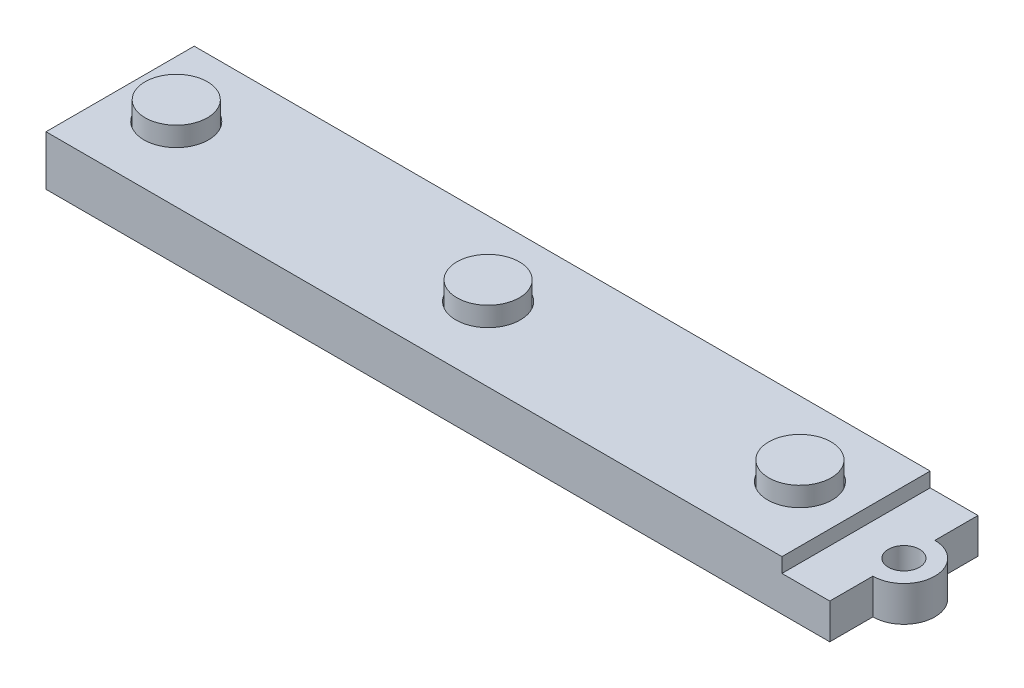
ISO-10303-21;
HEADER;
FILE_DESCRIPTION(('STEP AP214'),'2;1');
FILE_NAME('part.step','',(''),(''),'','','');
FILE_SCHEMA(('AUTOMOTIVE_DESIGN { 1 0 10303 214 1 1 1 1 }'));
ENDSEC;
DATA;
#1=APPLICATION_CONTEXT('core data for automotive mechanical design processes');
#2=APPLICATION_PROTOCOL_DEFINITION('international standard','automotive_design',2000,#1);
#3=PRODUCT_CONTEXT('',#1,'mechanical');
#4=PRODUCT('Part','Part','',(#3));
#5=PRODUCT_RELATED_PRODUCT_CATEGORY('part','',(#4));
#6=PRODUCT_DEFINITION_FORMATION('','',#4);
#7=PRODUCT_DEFINITION_CONTEXT('part definition',#1,'design');
#8=PRODUCT_DEFINITION('design','',#6,#7);
#9=PRODUCT_DEFINITION_SHAPE('','',#8);
#10=(LENGTH_UNIT() NAMED_UNIT(*) SI_UNIT(.MILLI.,.METRE.));
#11=(NAMED_UNIT(*) PLANE_ANGLE_UNIT() SI_UNIT($,.RADIAN.));
#12=(NAMED_UNIT(*) SI_UNIT($,.STERADIAN.) SOLID_ANGLE_UNIT());
#13=UNCERTAINTY_MEASURE_WITH_UNIT(LENGTH_MEASURE(1.E-05),#10,'distance_accuracy_value','');
#14=(GEOMETRIC_REPRESENTATION_CONTEXT(3) GLOBAL_UNCERTAINTY_ASSIGNED_CONTEXT((#13)) GLOBAL_UNIT_ASSIGNED_CONTEXT((#10,
#11,#12)) REPRESENTATION_CONTEXT('',''));
#15=CARTESIAN_POINT('',(0.,0.,0.));
#16=DIRECTION('',(0.,0.,1.));
#17=DIRECTION('',(1.,0.,0.));
#18=AXIS2_PLACEMENT_3D('',#15,#16,#17);
#19=CARTESIAN_POINT('',(0.,0.,0.));
#20=DIRECTION('',(0.,1.,0.));
#21=DIRECTION('',(0.,0.,1.));
#22=AXIS2_PLACEMENT_3D('',#19,#20,#21);
#23=PLANE('',#22);
#24=CARTESIAN_POINT('',(-20.4046666666667,0.,-25.8942737373737));
#25=DIRECTION('',(0.,1.,0.));
#26=DIRECTION('',(0.,0.,1.));
#27=AXIS2_PLACEMENT_3D('',#24,#25,#26);
#28=CIRCLE('',#27,1.905);
#29=CARTESIAN_POINT('',(-20.4046666666667,0.,-23.9892737373737));
#30=VERTEX_POINT('',#29);
#31=EDGE_CURVE('E210',#30,#30,#28,.T.);
#32=ORIENTED_EDGE('',*,*,#31,.T.);
#33=EDGE_LOOP('',(#32));
#34=FACE_BOUND('',#33,.T.);
#35=DIRECTION('',(0.,0.,-1.));
#36=VECTOR('',#35,1.);
#37=CARTESIAN_POINT('',(-112.479666666667,0.,-32.2442737373737));
#38=LINE('',#37,#36);
#39=CARTESIAN_POINT('',(-112.479666666667,0.,-19.5442737373737));
#40=VERTEX_POINT('',#39);
#41=CARTESIAN_POINT('',(-112.479666666667,0.,-32.2442737373737));
#42=VERTEX_POINT('',#41);
#43=EDGE_CURVE('E161',#40,#42,#38,.T.);
#44=ORIENTED_EDGE('',*,*,#43,.F.);
#45=DIRECTION('',(-1.,0.,0.));
#46=VECTOR('',#45,1.);
#47=CARTESIAN_POINT('',(-29.9296666666666,0.,-19.5442737373737));
#48=LINE('',#47,#46);
#49=CARTESIAN_POINT('',(-29.9296666666666,0.,-19.5442737373737));
#50=VERTEX_POINT('',#49);
#51=EDGE_CURVE('E166',#50,#40,#48,.T.);
#52=ORIENTED_EDGE('',*,*,#51,.F.);
#53=DIRECTION('',(0.,0.,1.));
#54=VECTOR('',#53,1.);
#55=CARTESIAN_POINT('',(-29.9296666666666,0.,-32.2442737373737));
#56=LINE('',#55,#54);
#57=CARTESIAN_POINT('',(-29.9296666666666,0.,-32.2442737373737));
#58=VERTEX_POINT('',#57);
#59=EDGE_CURVE('E176',#58,#50,#56,.T.);
#60=ORIENTED_EDGE('',*,*,#59,.F.);
#61=DIRECTION('',(1.,0.,0.));
#62=VECTOR('',#61,1.);
#63=CARTESIAN_POINT('',(-29.9296666666666,0.,-32.2442737373737));
#64=LINE('',#63,#62);
#65=EDGE_CURVE('E59',#42,#58,#64,.T.);
#66=ORIENTED_EDGE('',*,*,#65,.F.);
#67=EDGE_LOOP('',(#44,#52,#60,#66));
#68=FACE_BOUND('',#67,.T.);
#69=DIRECTION('',(-1.,0.,0.));
#70=VECTOR('',#69,1.);
#71=CARTESIAN_POINT('',(-116.162666666667,0.,-34.9493737373737));
#72=LINE('',#71,#70);
#73=CARTESIAN_POINT('',(-20.4046666666667,0.,-34.9493737373737));
#74=VERTEX_POINT('',#73);
#75=CARTESIAN_POINT('',(-116.162666666667,0.,-34.9493737373737));
#76=VERTEX_POINT('',#75);
#77=EDGE_CURVE('E232',#74,#76,#72,.T.);
#78=ORIENTED_EDGE('',*,*,#77,.F.);
#79=DIRECTION('',(0.,0.,1.));
#80=VECTOR('',#79,1.);
#81=CARTESIAN_POINT('',(-20.4046666666667,0.,0.));
#82=LINE('',#81,#80);
#83=CARTESIAN_POINT('',(-20.4046666666667,0.,-29.6800450522713));
#84=VERTEX_POINT('',#83);
#85=EDGE_CURVE('E158',#74,#84,#82,.T.);
#86=ORIENTED_EDGE('',*,*,#85,.T.);
#87=CARTESIAN_POINT('',(-20.4046666666667,0.,-25.8942737373737));
#88=DIRECTION('',(0.,1.,0.));
#89=DIRECTION('',(0.,0.,1.));
#90=AXIS2_PLACEMENT_3D('',#87,#88,#89);
#91=CIRCLE('',#90,3.78577131489756);
#92=CARTESIAN_POINT('',(-20.4046666666667,0.,-22.1085024224762));
#93=VERTEX_POINT('',#92);
#94=EDGE_CURVE('E154',#84,#93,#91,.F.);
#95=ORIENTED_EDGE('',*,*,#94,.T.);
#96=DIRECTION('',(0.,0.,1.));
#97=VECTOR('',#96,1.);
#98=CARTESIAN_POINT('',(-20.4046666666666,0.,0.));
#99=LINE('',#98,#97);
#100=CARTESIAN_POINT('',(-20.4046666666666,0.,-16.8391737373737));
#101=VERTEX_POINT('',#100);
#102=EDGE_CURVE('E132',#93,#101,#99,.T.);
#103=ORIENTED_EDGE('',*,*,#102,.T.);
#104=DIRECTION('',(1.,0.,0.));
#105=VECTOR('',#104,1.);
#106=CARTESIAN_POINT('',(-116.162666666667,0.,-16.8391737373737));
#107=LINE('',#106,#105);
#108=CARTESIAN_POINT('',(-116.162666666667,0.,-16.8391737373737));
#109=VERTEX_POINT('',#108);
#110=EDGE_CURVE('E239',#109,#101,#107,.T.);
#111=ORIENTED_EDGE('',*,*,#110,.F.);
#112=DIRECTION('',(0.,0.,1.));
#113=VECTOR('',#112,1.);
#114=CARTESIAN_POINT('',(-116.162666666667,0.,-34.9493737373737));
#115=LINE('',#114,#113);
#116=EDGE_CURVE('E225',#76,#109,#115,.T.);
#117=ORIENTED_EDGE('',*,*,#116,.F.);
#118=EDGE_LOOP('',(#78,#86,#95,#103,#111,#117));
#119=FACE_BOUND('',#118,.T.);
#120=ADVANCED_FACE('F36',(#34,#68,#119),#23,.F.);
#121=CARTESIAN_POINT('',(0.,4.318,0.));
#122=DIRECTION('',(0.,1.,0.));
#123=DIRECTION('',(0.,0.,1.));
#124=AXIS2_PLACEMENT_3D('',#121,#122,#123);
#125=PLANE('',#124);
#126=CARTESIAN_POINT('',(-20.4046666666667,4.318,-25.8942737373737));
#127=DIRECTION('',(0.,1.,0.));
#128=DIRECTION('',(0.,0.,1.));
#129=AXIS2_PLACEMENT_3D('',#126,#127,#128);
#130=CIRCLE('',#129,1.905);
#131=CARTESIAN_POINT('',(-20.4046666666667,4.318,-23.9892737373737));
#132=VERTEX_POINT('',#131);
#133=EDGE_CURVE('E207',#132,#132,#130,.T.);
#134=ORIENTED_EDGE('',*,*,#133,.F.);
#135=EDGE_LOOP('',(#134));
#136=FACE_BOUND('',#135,.T.);
#137=DIRECTION('',(0.,0.,1.));
#138=VECTOR('',#137,1.);
#139=CARTESIAN_POINT('',(-20.4046666666667,4.318,-34.9493737373737));
#140=LINE('',#139,#138);
#141=CARTESIAN_POINT('',(-20.4046666666667,4.318,-34.9493737373737));
#142=VERTEX_POINT('',#141);
#143=CARTESIAN_POINT('',(-20.4046666666667,4.318,-29.6800450522713));
#144=VERTEX_POINT('',#143);
#145=EDGE_CURVE('E51',#142,#144,#140,.T.);
#146=ORIENTED_EDGE('',*,*,#145,.F.);
#147=DIRECTION('',(-1.,0.,0.));
#148=VECTOR('',#147,1.);
#149=CARTESIAN_POINT('',(-26.2466666666667,4.318,-34.9493737373737));
#150=LINE('',#149,#148);
#151=CARTESIAN_POINT('',(-26.2466666666667,4.318,-34.9493737373737));
#152=VERTEX_POINT('',#151);
#153=EDGE_CURVE('E219',#142,#152,#150,.T.);
#154=ORIENTED_EDGE('',*,*,#153,.T.);
#155=DIRECTION('',(0.,0.,1.));
#156=VECTOR('',#155,1.);
#157=CARTESIAN_POINT('',(-26.2466666666667,4.318,-34.9493737373737));
#158=LINE('',#157,#156);
#159=CARTESIAN_POINT('',(-26.2466666666667,4.318,-16.8391737373737));
#160=VERTEX_POINT('',#159);
#161=EDGE_CURVE('E216',#152,#160,#158,.T.);
#162=ORIENTED_EDGE('',*,*,#161,.T.);
#163=DIRECTION('',(1.,0.,0.));
#164=VECTOR('',#163,1.);
#165=CARTESIAN_POINT('',(-26.2466666666667,4.318,-16.8391737373737));
#166=LINE('',#165,#164);
#167=CARTESIAN_POINT('',(-20.4046666666666,4.318,-16.8391737373737));
#168=VERTEX_POINT('',#167);
#169=EDGE_CURVE('E147',#160,#168,#166,.T.);
#170=ORIENTED_EDGE('',*,*,#169,.T.);
#171=DIRECTION('',(0.,0.,1.));
#172=VECTOR('',#171,1.);
#173=CARTESIAN_POINT('',(-20.4046666666667,4.318,-22.1085024224762));
#174=LINE('',#173,#172);
#175=CARTESIAN_POINT('',(-20.4046666666667,4.318,-22.1085024224762));
#176=VERTEX_POINT('',#175);
#177=EDGE_CURVE('E129',#176,#168,#174,.T.);
#178=ORIENTED_EDGE('',*,*,#177,.F.);
#179=CARTESIAN_POINT('',(-20.4046666666667,4.318,-25.8942737373737));
#180=DIRECTION('',(0.,-1.,0.));
#181=DIRECTION('',(0.,0.,1.));
#182=AXIS2_PLACEMENT_3D('',#179,#180,#181);
#183=CIRCLE('',#182,3.78577131489756);
#184=EDGE_CURVE('E139',#144,#176,#183,.T.);
#185=ORIENTED_EDGE('',*,*,#184,.F.);
#186=EDGE_LOOP('',(#146,#154,#162,#170,#178,#185));
#187=FACE_BOUND('',#186,.T.);
#188=ADVANCED_FACE('F144',(#136,#187),#125,.T.);
#189=CARTESIAN_POINT('',(-116.162666666667,6.096,-34.9493737373737));
#190=DIRECTION('',(1.,0.,0.));
#191=DIRECTION('',(0.,0.,-1.));
#192=AXIS2_PLACEMENT_3D('',#189,#190,#191);
#193=PLANE('',#192);
#194=ORIENTED_EDGE('',*,*,#116,.T.);
#195=DIRECTION('',(0.,-1.,0.));
#196=VECTOR('',#195,1.);
#197=CARTESIAN_POINT('',(-116.162666666667,6.096,-16.8391737373737));
#198=LINE('',#197,#196);
#199=CARTESIAN_POINT('',(-116.162666666667,6.096,-16.8391737373737));
#200=VERTEX_POINT('',#199);
#201=EDGE_CURVE('E11',#200,#109,#198,.T.);
#202=ORIENTED_EDGE('',*,*,#201,.F.);
#203=DIRECTION('',(0.,0.,1.));
#204=VECTOR('',#203,1.);
#205=CARTESIAN_POINT('',(-116.162666666667,6.096,-34.9493737373737));
#206=LINE('',#205,#204);
#207=CARTESIAN_POINT('',(-116.162666666667,6.096,-34.9493737373737));
#208=VERTEX_POINT('',#207);
#209=EDGE_CURVE('E228',#208,#200,#206,.T.);
#210=ORIENTED_EDGE('',*,*,#209,.F.);
#211=DIRECTION('',(0.,-1.,0.));
#212=VECTOR('',#211,1.);
#213=CARTESIAN_POINT('',(-116.162666666667,6.096,-34.9493737373737));
#214=LINE('',#213,#212);
#215=EDGE_CURVE('E44',#208,#76,#214,.T.);
#216=ORIENTED_EDGE('',*,*,#215,.T.);
#217=EDGE_LOOP('',(#194,#202,#210,#216));
#218=FACE_BOUND('',#217,.T.);
#219=ADVANCED_FACE('F38',(#218),#193,.F.);
#220=CARTESIAN_POINT('',(-116.162666666667,6.096,-16.8391737373737));
#221=DIRECTION('',(0.,0.,-1.));
#222=DIRECTION('',(-1.,0.,0.));
#223=AXIS2_PLACEMENT_3D('',#220,#221,#222);
#224=PLANE('',#223);
#225=ORIENTED_EDGE('',*,*,#110,.T.);
#226=DIRECTION('',(0.,1.,0.));
#227=VECTOR('',#226,1.);
#228=CARTESIAN_POINT('',(-20.4046666666666,-1.27,-16.8391737373737));
#229=LINE('',#228,#227);
#230=EDGE_CURVE('E135',#101,#168,#229,.T.);
#231=ORIENTED_EDGE('',*,*,#230,.T.);
#232=ORIENTED_EDGE('',*,*,#169,.F.);
#233=DIRECTION('',(0.,1.,0.));
#234=VECTOR('',#233,1.);
#235=CARTESIAN_POINT('',(-26.2466666666667,4.318,-16.8391737373737));
#236=LINE('',#235,#234);
#237=CARTESIAN_POINT('',(-26.2466666666667,6.096,-16.8391737373737));
#238=VERTEX_POINT('',#237);
#239=EDGE_CURVE('E221',#160,#238,#236,.T.);
#240=ORIENTED_EDGE('',*,*,#239,.T.);
#241=DIRECTION('',(1.,0.,0.));
#242=VECTOR('',#241,1.);
#243=CARTESIAN_POINT('',(-116.162666666667,6.096,-16.8391737373737));
#244=LINE('',#243,#242);
#245=EDGE_CURVE('E231',#200,#238,#244,.T.);
#246=ORIENTED_EDGE('',*,*,#245,.F.);
#247=ORIENTED_EDGE('',*,*,#201,.T.);
#248=EDGE_LOOP('',(#225,#231,#232,#240,#246,#247));
#249=FACE_BOUND('',#248,.T.);
#250=ADVANCED_FACE('F253',(#249),#224,.F.);
#251=CARTESIAN_POINT('',(-116.162666666667,6.096,-34.9493737373737));
#252=DIRECTION('',(0.,0.,1.));
#253=DIRECTION('',(1.,0.,0.));
#254=AXIS2_PLACEMENT_3D('',#251,#252,#253);
#255=PLANE('',#254);
#256=ORIENTED_EDGE('',*,*,#153,.F.);
#257=DIRECTION('',(0.,1.,0.));
#258=VECTOR('',#257,1.);
#259=CARTESIAN_POINT('',(-20.4046666666667,-1.27,-34.9493737373737));
#260=LINE('',#259,#258);
#261=EDGE_CURVE('E152',#74,#142,#260,.T.);
#262=ORIENTED_EDGE('',*,*,#261,.F.);
#263=ORIENTED_EDGE('',*,*,#77,.T.);
#264=ORIENTED_EDGE('',*,*,#215,.F.);
#265=DIRECTION('',(-1.,0.,0.));
#266=VECTOR('',#265,1.);
#267=CARTESIAN_POINT('',(-116.162666666667,6.096,-34.9493737373737));
#268=LINE('',#267,#266);
#269=CARTESIAN_POINT('',(-26.2466666666667,6.096,-34.9493737373737));
#270=VERTEX_POINT('',#269);
#271=EDGE_CURVE('E235',#270,#208,#268,.T.);
#272=ORIENTED_EDGE('',*,*,#271,.F.);
#273=DIRECTION('',(0.,1.,0.));
#274=VECTOR('',#273,1.);
#275=CARTESIAN_POINT('',(-26.2466666666667,4.318,-34.9493737373737));
#276=LINE('',#275,#274);
#277=EDGE_CURVE('E223',#152,#270,#276,.T.);
#278=ORIENTED_EDGE('',*,*,#277,.F.);
#279=EDGE_LOOP('',(#256,#262,#263,#264,#272,#278));
#280=FACE_BOUND('',#279,.T.);
#281=ADVANCED_FACE('F259',(#280),#255,.F.);
#282=CARTESIAN_POINT('',(0.,6.096,0.));
#283=DIRECTION('',(0.,1.,0.));
#284=DIRECTION('',(0.,0.,1.));
#285=AXIS2_PLACEMENT_3D('',#282,#283,#284);
#286=PLANE('',#285);
#287=CARTESIAN_POINT('',(-71.2046666666667,6.096,-25.8942737373734));
#288=DIRECTION('',(0.,1.,0.));
#289=DIRECTION('',(0.,0.,1.));
#290=AXIS2_PLACEMENT_3D('',#287,#288,#289);
#291=CIRCLE('',#290,3.937);
#292=CARTESIAN_POINT('',(-71.2046666666667,6.096,-21.9572737373734));
#293=VERTEX_POINT('',#292);
#294=EDGE_CURVE('E196',#293,#293,#291,.T.);
#295=ORIENTED_EDGE('',*,*,#294,.F.);
#296=EDGE_LOOP('',(#295));
#297=FACE_BOUND('',#296,.T.);
#298=CARTESIAN_POINT('',(-109.304666666667,6.096,-25.8942737373732));
#299=DIRECTION('',(0.,1.,0.));
#300=DIRECTION('',(0.,0.,1.));
#301=AXIS2_PLACEMENT_3D('',#298,#299,#300);
#302=CIRCLE('',#301,3.937);
#303=CARTESIAN_POINT('',(-109.304666666667,6.096,-21.9572737373732));
#304=VERTEX_POINT('',#303);
#305=EDGE_CURVE('E191',#304,#304,#302,.T.);
#306=ORIENTED_EDGE('',*,*,#305,.F.);
#307=EDGE_LOOP('',(#306));
#308=FACE_BOUND('',#307,.T.);
#309=CARTESIAN_POINT('',(-33.1046666666667,6.096,-25.8942737373737));
#310=DIRECTION('',(0.,1.,0.));
#311=DIRECTION('',(0.,0.,1.));
#312=AXIS2_PLACEMENT_3D('',#309,#310,#311);
#313=CIRCLE('',#312,3.937);
#314=CARTESIAN_POINT('',(-33.1046666666667,6.096,-21.9572737373737));
#315=VERTEX_POINT('',#314);
#316=EDGE_CURVE('E195',#315,#315,#313,.T.);
#317=ORIENTED_EDGE('',*,*,#316,.F.);
#318=EDGE_LOOP('',(#317));
#319=FACE_BOUND('',#318,.T.);
#320=DIRECTION('',(0.,0.,1.));
#321=VECTOR('',#320,1.);
#322=CARTESIAN_POINT('',(-26.2466666666667,6.096,-34.9493737373737));
#323=LINE('',#322,#321);
#324=EDGE_CURVE('E213',#270,#238,#323,.T.);
#325=ORIENTED_EDGE('',*,*,#324,.F.);
#326=ORIENTED_EDGE('',*,*,#271,.T.);
#327=ORIENTED_EDGE('',*,*,#209,.T.);
#328=ORIENTED_EDGE('',*,*,#245,.T.);
#329=EDGE_LOOP('',(#325,#326,#327,#328));
#330=FACE_BOUND('',#329,.T.);
#331=ADVANCED_FACE('F256',(#297,#308,#319,#330),#286,.T.);
#332=CARTESIAN_POINT('',(-26.2466666666667,4.318,-34.9493737373737));
#333=DIRECTION('',(-1.,0.,0.));
#334=DIRECTION('',(0.,0.,1.));
#335=AXIS2_PLACEMENT_3D('',#332,#333,#334);
#336=PLANE('',#335);
#337=ORIENTED_EDGE('',*,*,#324,.T.);
#338=ORIENTED_EDGE('',*,*,#239,.F.);
#339=ORIENTED_EDGE('',*,*,#161,.F.);
#340=ORIENTED_EDGE('',*,*,#277,.T.);
#341=EDGE_LOOP('',(#337,#338,#339,#340));
#342=FACE_BOUND('',#341,.T.);
#343=ADVANCED_FACE('F263',(#342),#336,.F.);
#344=CARTESIAN_POINT('',(-20.4046666666667,0.,-25.8942737373737));
#345=DIRECTION('',(0.,1.,0.));
#346=DIRECTION('',(0.,0.,1.));
#347=AXIS2_PLACEMENT_3D('',#344,#345,#346);
#348=CYLINDRICAL_SURFACE('',#347,1.905);
#349=ORIENTED_EDGE('',*,*,#31,.F.);
#350=EDGE_LOOP('',(#349));
#351=FACE_BOUND('',#350,.T.);
#352=ORIENTED_EDGE('',*,*,#133,.T.);
#353=EDGE_LOOP('',(#352));
#354=FACE_BOUND('',#353,.T.);
#355=ADVANCED_FACE('F315',(#351,#354),#348,.F.);
#356=CARTESIAN_POINT('',(-33.1046666666667,4.826,-25.8942737373737));
#357=DIRECTION('',(0.,1.,0.));
#358=DIRECTION('',(0.,0.,1.));
#359=AXIS2_PLACEMENT_3D('',#356,#357,#358);
#360=CYLINDRICAL_SURFACE('',#359,3.937);
#361=CARTESIAN_POINT('',(-33.1046666666667,4.826,-25.8942737373737));
#362=DIRECTION('',(0.,1.,0.));
#363=DIRECTION('',(0.,0.,1.));
#364=AXIS2_PLACEMENT_3D('',#361,#362,#363);
#365=CIRCLE('',#364,3.937);
#366=CARTESIAN_POINT('',(-33.1046666666667,4.826,-21.9572737373737));
#367=VERTEX_POINT('',#366);
#368=EDGE_CURVE('E204',#367,#367,#365,.T.);
#369=ORIENTED_EDGE('',*,*,#368,.F.);
#370=EDGE_LOOP('',(#369));
#371=FACE_BOUND('',#370,.T.);
#372=ORIENTED_EDGE('',*,*,#316,.T.);
#373=EDGE_LOOP('',(#372));
#374=FACE_BOUND('',#373,.T.);
#375=ADVANCED_FACE('F313',(#371,#374),#360,.F.);
#376=CARTESIAN_POINT('',(-33.1046666666667,4.826,-25.8942737373737));
#377=DIRECTION('',(0.,1.,0.));
#378=DIRECTION('',(0.,0.,1.));
#379=AXIS2_PLACEMENT_3D('',#376,#377,#378);
#380=PLANE('',#379);
#381=CARTESIAN_POINT('',(-33.1046666666667,4.826,-25.8942737373737));
#382=DIRECTION('',(0.,1.,0.));
#383=DIRECTION('',(0.,0.,1.));
#384=AXIS2_PLACEMENT_3D('',#381,#382,#383);
#385=CIRCLE('',#384,3.81);
#386=CARTESIAN_POINT('',(-33.1046666666667,4.826,-22.0842737373737));
#387=VERTEX_POINT('',#386);
#388=EDGE_CURVE('E266',#387,#387,#385,.T.);
#389=ORIENTED_EDGE('',*,*,#388,.F.);
#390=EDGE_LOOP('',(#389));
#391=FACE_BOUND('',#390,.T.);
#392=ORIENTED_EDGE('',*,*,#368,.T.);
#393=EDGE_LOOP('',(#392));
#394=FACE_BOUND('',#393,.T.);
#395=ADVANCED_FACE('F303',(#391,#394),#380,.T.);
#396=CARTESIAN_POINT('',(-109.304666666667,4.826,-25.8942737373732));
#397=DIRECTION('',(0.,1.,0.));
#398=DIRECTION('',(0.,0.,1.));
#399=AXIS2_PLACEMENT_3D('',#396,#397,#398);
#400=CYLINDRICAL_SURFACE('',#399,3.937);
#401=CARTESIAN_POINT('',(-109.304666666667,4.826,-25.8942737373732));
#402=DIRECTION('',(0.,1.,0.));
#403=DIRECTION('',(0.,0.,1.));
#404=AXIS2_PLACEMENT_3D('',#401,#402,#403);
#405=CIRCLE('',#404,3.937);
#406=CARTESIAN_POINT('',(-109.304666666667,4.826,-21.9572737373732));
#407=VERTEX_POINT('',#406);
#408=EDGE_CURVE('E199',#407,#407,#405,.T.);
#409=ORIENTED_EDGE('',*,*,#408,.F.);
#410=EDGE_LOOP('',(#409));
#411=FACE_BOUND('',#410,.T.);
#412=ORIENTED_EDGE('',*,*,#305,.T.);
#413=EDGE_LOOP('',(#412));
#414=FACE_BOUND('',#413,.T.);
#415=ADVANCED_FACE('F297',(#411,#414),#400,.F.);
#416=CARTESIAN_POINT('',(-109.304666666667,4.826,-25.8942737373732));
#417=DIRECTION('',(0.,1.,0.));
#418=DIRECTION('',(0.,0.,1.));
#419=AXIS2_PLACEMENT_3D('',#416,#417,#418);
#420=PLANE('',#419);
#421=CARTESIAN_POINT('',(-109.304666666667,4.826,-25.8942737373732));
#422=DIRECTION('',(0.,1.,0.));
#423=DIRECTION('',(0.,0.,1.));
#424=AXIS2_PLACEMENT_3D('',#421,#422,#423);
#425=CIRCLE('',#424,3.81);
#426=CARTESIAN_POINT('',(-109.304666666667,4.826,-22.0842737373732));
#427=VERTEX_POINT('',#426);
#428=EDGE_CURVE('E278',#427,#427,#425,.T.);
#429=ORIENTED_EDGE('',*,*,#428,.F.);
#430=EDGE_LOOP('',(#429));
#431=FACE_BOUND('',#430,.T.);
#432=ORIENTED_EDGE('',*,*,#408,.T.);
#433=EDGE_LOOP('',(#432));
#434=FACE_BOUND('',#433,.T.);
#435=ADVANCED_FACE('F293',(#431,#434),#420,.T.);
#436=CARTESIAN_POINT('',(-71.2046666666667,4.826,-25.8942737373734));
#437=DIRECTION('',(0.,1.,0.));
#438=DIRECTION('',(0.,0.,1.));
#439=AXIS2_PLACEMENT_3D('',#436,#437,#438);
#440=CYLINDRICAL_SURFACE('',#439,3.937);
#441=CARTESIAN_POINT('',(-71.2046666666667,4.826,-25.8942737373734));
#442=DIRECTION('',(0.,1.,0.));
#443=DIRECTION('',(0.,0.,1.));
#444=AXIS2_PLACEMENT_3D('',#441,#442,#443);
#445=CIRCLE('',#444,3.937);
#446=CARTESIAN_POINT('',(-71.2046666666667,4.826,-21.9572737373734));
#447=VERTEX_POINT('',#446);
#448=EDGE_CURVE('E192',#447,#447,#445,.T.);
#449=ORIENTED_EDGE('',*,*,#448,.F.);
#450=EDGE_LOOP('',(#449));
#451=FACE_BOUND('',#450,.T.);
#452=ORIENTED_EDGE('',*,*,#294,.T.);
#453=EDGE_LOOP('',(#452));
#454=FACE_BOUND('',#453,.T.);
#455=ADVANCED_FACE('F296',(#451,#454),#440,.F.);
#456=CARTESIAN_POINT('',(-71.2046666666667,4.826,-25.8942737373734));
#457=DIRECTION('',(0.,1.,0.));
#458=DIRECTION('',(0.,0.,1.));
#459=AXIS2_PLACEMENT_3D('',#456,#457,#458);
#460=PLANE('',#459);
#461=CARTESIAN_POINT('',(-71.2046666666667,4.826,-25.8942737373734));
#462=DIRECTION('',(0.,1.,0.));
#463=DIRECTION('',(0.,0.,1.));
#464=AXIS2_PLACEMENT_3D('',#461,#462,#463);
#465=CIRCLE('',#464,3.81000000000001);
#466=CARTESIAN_POINT('',(-71.2046666666667,4.826,-22.0842737373734));
#467=VERTEX_POINT('',#466);
#468=EDGE_CURVE('E272',#467,#467,#465,.T.);
#469=ORIENTED_EDGE('',*,*,#468,.F.);
#470=EDGE_LOOP('',(#469));
#471=FACE_BOUND('',#470,.T.);
#472=ORIENTED_EDGE('',*,*,#448,.T.);
#473=EDGE_LOOP('',(#472));
#474=FACE_BOUND('',#473,.T.);
#475=ADVANCED_FACE('F413',(#471,#474),#460,.T.);
#476=CARTESIAN_POINT('',(-112.479666666667,-1.27,-32.2442737373737));
#477=DIRECTION('',(1.,0.,0.));
#478=DIRECTION('',(0.,0.,-1.));
#479=AXIS2_PLACEMENT_3D('',#476,#477,#478);
#480=PLANE('',#479);
#481=ORIENTED_EDGE('',*,*,#43,.T.);
#482=DIRECTION('',(0.,1.,0.));
#483=VECTOR('',#482,1.);
#484=CARTESIAN_POINT('',(-112.479666666667,-1.27,-32.2442737373737));
#485=LINE('',#484,#483);
#486=CARTESIAN_POINT('',(-112.479666666667,-1.27,-32.2442737373737));
#487=VERTEX_POINT('',#486);
#488=EDGE_CURVE('E189',#487,#42,#485,.T.);
#489=ORIENTED_EDGE('',*,*,#488,.F.);
#490=DIRECTION('',(0.,0.,-1.));
#491=VECTOR('',#490,1.);
#492=CARTESIAN_POINT('',(-112.479666666667,-1.27,-32.2442737373737));
#493=LINE('',#492,#491);
#494=CARTESIAN_POINT('',(-112.479666666667,-1.27,-19.5442737373737));
#495=VERTEX_POINT('',#494);
#496=EDGE_CURVE('E162',#495,#487,#493,.T.);
#497=ORIENTED_EDGE('',*,*,#496,.F.);
#498=DIRECTION('',(0.,1.,0.));
#499=VECTOR('',#498,1.);
#500=CARTESIAN_POINT('',(-112.479666666667,-1.27,-19.5442737373737));
#501=LINE('',#500,#499);
#502=EDGE_CURVE('E172',#495,#40,#501,.T.);
#503=ORIENTED_EDGE('',*,*,#502,.T.);
#504=EDGE_LOOP('',(#481,#489,#497,#503));
#505=FACE_BOUND('',#504,.T.);
#506=ADVANCED_FACE('F402',(#505),#480,.F.);
#507=CARTESIAN_POINT('',(-29.9296666666666,-1.27,-32.2442737373737));
#508=DIRECTION('',(0.,0.,1.));
#509=DIRECTION('',(1.,0.,0.));
#510=AXIS2_PLACEMENT_3D('',#507,#508,#509);
#511=PLANE('',#510);
#512=ORIENTED_EDGE('',*,*,#65,.T.);
#513=DIRECTION('',(0.,1.,0.));
#514=VECTOR('',#513,1.);
#515=CARTESIAN_POINT('',(-29.9296666666666,-1.27,-32.2442737373737));
#516=LINE('',#515,#514);
#517=CARTESIAN_POINT('',(-29.9296666666666,-1.27,-32.2442737373737));
#518=VERTEX_POINT('',#517);
#519=EDGE_CURVE('E186',#518,#58,#516,.T.);
#520=ORIENTED_EDGE('',*,*,#519,.F.);
#521=DIRECTION('',(1.,0.,0.));
#522=VECTOR('',#521,1.);
#523=CARTESIAN_POINT('',(-29.9296666666666,-1.27,-32.2442737373737));
#524=LINE('',#523,#522);
#525=EDGE_CURVE('E165',#487,#518,#524,.T.);
#526=ORIENTED_EDGE('',*,*,#525,.F.);
#527=ORIENTED_EDGE('',*,*,#488,.T.);
#528=EDGE_LOOP('',(#512,#520,#526,#527));
#529=FACE_BOUND('',#528,.T.);
#530=ADVANCED_FACE('F391',(#529),#511,.F.);
#531=CARTESIAN_POINT('',(-29.9296666666666,-1.27,-32.2442737373737));
#532=DIRECTION('',(-1.,0.,0.));
#533=DIRECTION('',(0.,0.,1.));
#534=AXIS2_PLACEMENT_3D('',#531,#532,#533);
#535=PLANE('',#534);
#536=ORIENTED_EDGE('',*,*,#59,.T.);
#537=DIRECTION('',(0.,1.,0.));
#538=VECTOR('',#537,1.);
#539=CARTESIAN_POINT('',(-29.9296666666666,-1.27,-19.5442737373737));
#540=LINE('',#539,#538);
#541=CARTESIAN_POINT('',(-29.9296666666666,-1.27,-19.5442737373737));
#542=VERTEX_POINT('',#541);
#543=EDGE_CURVE('E183',#542,#50,#540,.T.);
#544=ORIENTED_EDGE('',*,*,#543,.F.);
#545=DIRECTION('',(0.,0.,1.));
#546=VECTOR('',#545,1.);
#547=CARTESIAN_POINT('',(-29.9296666666666,-1.27,-32.2442737373737));
#548=LINE('',#547,#546);
#549=EDGE_CURVE('E168',#518,#542,#548,.T.);
#550=ORIENTED_EDGE('',*,*,#549,.F.);
#551=ORIENTED_EDGE('',*,*,#519,.T.);
#552=EDGE_LOOP('',(#536,#544,#550,#551));
#553=FACE_BOUND('',#552,.T.);
#554=ADVANCED_FACE('F380',(#553),#535,.F.);
#555=CARTESIAN_POINT('',(-29.9296666666666,-1.27,-19.5442737373737));
#556=DIRECTION('',(0.,0.,-1.));
#557=DIRECTION('',(-1.,0.,0.));
#558=AXIS2_PLACEMENT_3D('',#555,#556,#557);
#559=PLANE('',#558);
#560=ORIENTED_EDGE('',*,*,#51,.T.);
#561=ORIENTED_EDGE('',*,*,#502,.F.);
#562=DIRECTION('',(-1.,0.,0.));
#563=VECTOR('',#562,1.);
#564=CARTESIAN_POINT('',(-29.9296666666666,-1.27,-19.5442737373737));
#565=LINE('',#564,#563);
#566=EDGE_CURVE('E170',#542,#495,#565,.T.);
#567=ORIENTED_EDGE('',*,*,#566,.F.);
#568=ORIENTED_EDGE('',*,*,#543,.T.);
#569=EDGE_LOOP('',(#560,#561,#567,#568));
#570=FACE_BOUND('',#569,.T.);
#571=ADVANCED_FACE('F368',(#570),#559,.F.);
#572=CARTESIAN_POINT('',(0.,-1.27,0.));
#573=DIRECTION('',(0.,-1.,0.));
#574=DIRECTION('',(0.,0.,-1.));
#575=AXIS2_PLACEMENT_3D('',#572,#573,#574);
#576=PLANE('',#575);
#577=ORIENTED_EDGE('',*,*,#496,.T.);
#578=ORIENTED_EDGE('',*,*,#525,.T.);
#579=ORIENTED_EDGE('',*,*,#549,.T.);
#580=ORIENTED_EDGE('',*,*,#566,.T.);
#581=EDGE_LOOP('',(#577,#578,#579,#580));
#582=FACE_BOUND('',#581,.T.);
#583=ADVANCED_FACE('F361',(#582),#576,.T.);
#584=CARTESIAN_POINT('',(-20.4046666666667,-1.27,-34.9493737373737));
#585=DIRECTION('',(-1.,0.,0.));
#586=DIRECTION('',(0.,0.,1.));
#587=AXIS2_PLACEMENT_3D('',#584,#585,#586);
#588=PLANE('',#587);
#589=ORIENTED_EDGE('',*,*,#261,.T.);
#590=ORIENTED_EDGE('',*,*,#145,.T.);
#591=DIRECTION('',(0.,1.,0.));
#592=VECTOR('',#591,1.);
#593=CARTESIAN_POINT('',(-20.4046666666667,-1.27,-29.6800450522713));
#594=LINE('',#593,#592);
#595=EDGE_CURVE('E136',#84,#144,#594,.T.);
#596=ORIENTED_EDGE('',*,*,#595,.F.);
#597=ORIENTED_EDGE('',*,*,#85,.F.);
#598=EDGE_LOOP('',(#589,#590,#596,#597));
#599=FACE_BOUND('',#598,.T.);
#600=ADVANCED_FACE('F367',(#599),#588,.F.);
#601=CARTESIAN_POINT('',(-20.4046666666667,-1.27,-22.1085024224762));
#602=DIRECTION('',(-1.,0.,0.));
#603=DIRECTION('',(0.,0.,1.));
#604=AXIS2_PLACEMENT_3D('',#601,#602,#603);
#605=PLANE('',#604);
#606=DIRECTION('',(0.,1.,0.));
#607=VECTOR('',#606,1.);
#608=CARTESIAN_POINT('',(-20.4046666666667,-1.27,-22.1085024224762));
#609=LINE('',#608,#607);
#610=EDGE_CURVE('E125',#93,#176,#609,.T.);
#611=ORIENTED_EDGE('',*,*,#610,.T.);
#612=ORIENTED_EDGE('',*,*,#177,.T.);
#613=ORIENTED_EDGE('',*,*,#230,.F.);
#614=ORIENTED_EDGE('',*,*,#102,.F.);
#615=EDGE_LOOP('',(#611,#612,#613,#614));
#616=FACE_BOUND('',#615,.T.);
#617=ADVANCED_FACE('F127',(#616),#605,.F.);
#618=CARTESIAN_POINT('',(-20.4046666666667,-1.27,-25.8942737373737));
#619=DIRECTION('',(0.,1.,0.));
#620=DIRECTION('',(0.,0.,1.));
#621=AXIS2_PLACEMENT_3D('',#618,#619,#620);
#622=CYLINDRICAL_SURFACE('',#621,3.78577131489756);
#623=ORIENTED_EDGE('',*,*,#595,.T.);
#624=ORIENTED_EDGE('',*,*,#184,.T.);
#625=ORIENTED_EDGE('',*,*,#610,.F.);
#626=ORIENTED_EDGE('',*,*,#94,.F.);
#627=EDGE_LOOP('',(#623,#624,#625,#626));
#628=FACE_BOUND('',#627,.T.);
#629=ADVANCED_FACE('F140',(#628),#622,.T.);
#630=CARTESIAN_POINT('',(-33.1046666666667,8.382,-25.8942737373737));
#631=DIRECTION('',(0.,-1.,0.));
#632=DIRECTION('',(0.,0.,-1.));
#633=AXIS2_PLACEMENT_3D('',#630,#631,#632);
#634=CYLINDRICAL_SURFACE('',#633,3.81);
#635=CARTESIAN_POINT('',(-33.1046666666667,8.382,-25.8942737373737));
#636=DIRECTION('',(0.,1.,0.));
#637=DIRECTION('',(0.,0.,1.));
#638=AXIS2_PLACEMENT_3D('',#635,#636,#637);
#639=CIRCLE('',#638,3.81);
#640=CARTESIAN_POINT('',(-33.1046666666667,8.382,-22.0842737373737));
#641=VERTEX_POINT('',#640);
#642=EDGE_CURVE('E264',#641,#641,#639,.T.);
#643=ORIENTED_EDGE('',*,*,#642,.F.);
#644=EDGE_LOOP('',(#643));
#645=FACE_BOUND('',#644,.T.);
#646=ORIENTED_EDGE('',*,*,#388,.T.);
#647=EDGE_LOOP('',(#646));
#648=FACE_BOUND('',#647,.T.);
#649=ADVANCED_FACE('F506',(#645,#648),#634,.T.);
#650=CARTESIAN_POINT('',(-33.1046666666667,8.382,-25.8942737373737));
#651=DIRECTION('',(0.,1.,0.));
#652=DIRECTION('',(0.,0.,1.));
#653=AXIS2_PLACEMENT_3D('',#650,#651,#652);
#654=PLANE('',#653);
#655=ORIENTED_EDGE('',*,*,#642,.T.);
#656=EDGE_LOOP('',(#655));
#657=FACE_BOUND('',#656,.T.);
#658=ADVANCED_FACE('F534',(#657),#654,.T.);
#659=CARTESIAN_POINT('',(-71.2046666666667,8.382,-25.8942737373734));
#660=DIRECTION('',(0.,-1.,0.));
#661=DIRECTION('',(0.,0.,-1.));
#662=AXIS2_PLACEMENT_3D('',#659,#660,#661);
#663=CYLINDRICAL_SURFACE('',#662,3.81000000000001);
#664=CARTESIAN_POINT('',(-71.2046666666667,8.382,-25.8942737373734));
#665=DIRECTION('',(0.,1.,0.));
#666=DIRECTION('',(0.,0.,1.));
#667=AXIS2_PLACEMENT_3D('',#664,#665,#666);
#668=CIRCLE('',#667,3.81000000000001);
#669=CARTESIAN_POINT('',(-71.2046666666667,8.382,-22.0842737373734));
#670=VERTEX_POINT('',#669);
#671=EDGE_CURVE('E270',#670,#670,#668,.T.);
#672=ORIENTED_EDGE('',*,*,#671,.F.);
#673=EDGE_LOOP('',(#672));
#674=FACE_BOUND('',#673,.T.);
#675=ORIENTED_EDGE('',*,*,#468,.T.);
#676=EDGE_LOOP('',(#675));
#677=FACE_BOUND('',#676,.T.);
#678=ADVANCED_FACE('F545',(#674,#677),#663,.T.);
#679=CARTESIAN_POINT('',(-71.2046666666667,8.382,-25.8942737373734));
#680=DIRECTION('',(0.,1.,0.));
#681=DIRECTION('',(0.,0.,1.));
#682=AXIS2_PLACEMENT_3D('',#679,#680,#681);
#683=PLANE('',#682);
#684=ORIENTED_EDGE('',*,*,#671,.T.);
#685=EDGE_LOOP('',(#684));
#686=FACE_BOUND('',#685,.T.);
#687=ADVANCED_FACE('F289',(#686),#683,.T.);
#688=CARTESIAN_POINT('',(-109.304666666667,8.382,-25.8942737373732));
#689=DIRECTION('',(0.,-1.,0.));
#690=DIRECTION('',(0.,0.,-1.));
#691=AXIS2_PLACEMENT_3D('',#688,#689,#690);
#692=CYLINDRICAL_SURFACE('',#691,3.81);
#693=CARTESIAN_POINT('',(-109.304666666667,8.382,-25.8942737373732));
#694=DIRECTION('',(0.,1.,0.));
#695=DIRECTION('',(0.,0.,1.));
#696=AXIS2_PLACEMENT_3D('',#693,#694,#695);
#697=CIRCLE('',#696,3.81);
#698=CARTESIAN_POINT('',(-109.304666666667,8.382,-22.0842737373732));
#699=VERTEX_POINT('',#698);
#700=EDGE_CURVE('E275',#699,#699,#697,.T.);
#701=ORIENTED_EDGE('',*,*,#700,.F.);
#702=EDGE_LOOP('',(#701));
#703=FACE_BOUND('',#702,.T.);
#704=ORIENTED_EDGE('',*,*,#428,.T.);
#705=EDGE_LOOP('',(#704));
#706=FACE_BOUND('',#705,.T.);
#707=ADVANCED_FACE('F286',(#703,#706),#692,.T.);
#708=CARTESIAN_POINT('',(-109.304666666667,8.382,-25.8942737373732));
#709=DIRECTION('',(0.,1.,0.));
#710=DIRECTION('',(0.,0.,1.));
#711=AXIS2_PLACEMENT_3D('',#708,#709,#710);
#712=PLANE('',#711);
#713=ORIENTED_EDGE('',*,*,#700,.T.);
#714=EDGE_LOOP('',(#713));
#715=FACE_BOUND('',#714,.T.);
#716=ADVANCED_FACE('F284',(#715),#712,.T.);
#717=CLOSED_SHELL('',(#120,#188,#219,#250,#281,#331,#343,#355,#375,#395,#415,#435,#455,#475,
#506,#530,#554,#571,#583,#600,#617,#629,#649,#658,#678,#687,#707,#716));
#718=MANIFOLD_SOLID_BREP('B2',#717);
#719=ADVANCED_BREP_SHAPE_REPRESENTATION('',(#18,#718),#14);
#720=SHAPE_DEFINITION_REPRESENTATION(#9,#719);
ENDSEC;
END-ISO-10303-21;
